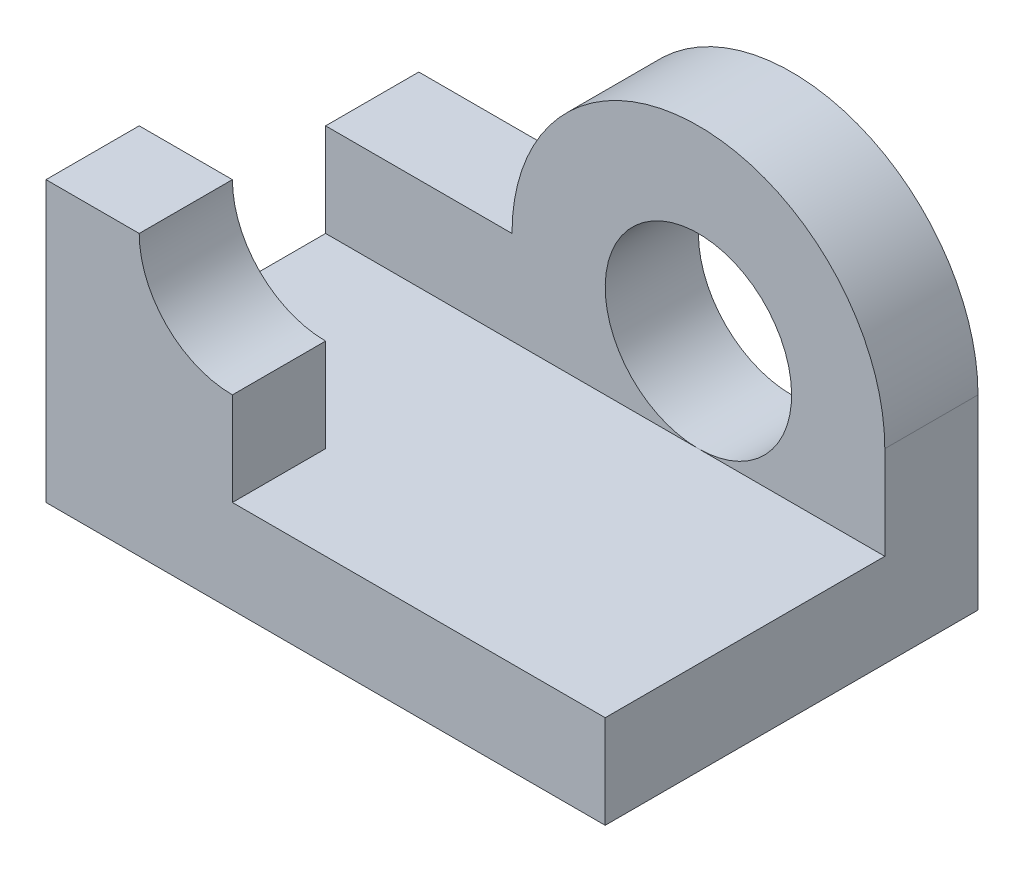
ISO-10303-21;
HEADER;
FILE_DESCRIPTION(('STEP AP214'),'2;1');
FILE_NAME('part.step','',(''),(''),'','','');
FILE_SCHEMA(('AUTOMOTIVE_DESIGN { 1 0 10303 214 1 1 1 1 }'));
ENDSEC;
DATA;
#1=APPLICATION_CONTEXT('core data for automotive mechanical design processes');
#2=APPLICATION_PROTOCOL_DEFINITION('international standard','automotive_design',2000,#1);
#3=PRODUCT_CONTEXT('',#1,'mechanical');
#4=PRODUCT('Part','Part','',(#3));
#5=PRODUCT_RELATED_PRODUCT_CATEGORY('part','',(#4));
#6=PRODUCT_DEFINITION_FORMATION('','',#4);
#7=PRODUCT_DEFINITION_CONTEXT('part definition',#1,'design');
#8=PRODUCT_DEFINITION('design','',#6,#7);
#9=PRODUCT_DEFINITION_SHAPE('','',#8);
#10=(LENGTH_UNIT() NAMED_UNIT(*) SI_UNIT(.MILLI.,.METRE.));
#11=(NAMED_UNIT(*) PLANE_ANGLE_UNIT() SI_UNIT($,.RADIAN.));
#12=(NAMED_UNIT(*) SI_UNIT($,.STERADIAN.) SOLID_ANGLE_UNIT());
#13=UNCERTAINTY_MEASURE_WITH_UNIT(LENGTH_MEASURE(1.E-05),#10,'distance_accuracy_value','');
#14=(GEOMETRIC_REPRESENTATION_CONTEXT(3) GLOBAL_UNCERTAINTY_ASSIGNED_CONTEXT((#13)) GLOBAL_UNIT_ASSIGNED_CONTEXT((#10,
#11,#12)) REPRESENTATION_CONTEXT('',''));
#15=CARTESIAN_POINT('',(0.,0.,0.));
#16=DIRECTION('',(0.,0.,1.));
#17=DIRECTION('',(1.,0.,0.));
#18=AXIS2_PLACEMENT_3D('',#15,#16,#17);
#19=CARTESIAN_POINT('',(10.,0.,5.));
#20=DIRECTION('',(1.,0.,0.));
#21=DIRECTION('',(0.,0.,-1.));
#22=AXIS2_PLACEMENT_3D('',#19,#20,#21);
#23=PLANE('',#22);
#24=DIRECTION('',(0.,-1.,0.));
#25=VECTOR('',#24,1.);
#26=CARTESIAN_POINT('',(10.,0.,5.));
#27=LINE('',#26,#25);
#28=CARTESIAN_POINT('',(10.,10.,5.));
#29=VERTEX_POINT('',#28);
#30=CARTESIAN_POINT('',(10.,5.,5.));
#31=VERTEX_POINT('',#30);
#32=EDGE_CURVE('E179',#29,#31,#27,.T.);
#33=ORIENTED_EDGE('',*,*,#32,.T.);
#34=DIRECTION('',(0.,0.,-1.));
#35=VECTOR('',#34,1.);
#36=CARTESIAN_POINT('',(10.,5.,20.));
#37=LINE('',#36,#35);
#38=CARTESIAN_POINT('',(10.,5.,20.));
#39=VERTEX_POINT('',#38);
#40=EDGE_CURVE('E170',#39,#31,#37,.T.);
#41=ORIENTED_EDGE('',*,*,#40,.F.);
#42=DIRECTION('',(0.,-1.,0.));
#43=VECTOR('',#42,1.);
#44=CARTESIAN_POINT('',(10.,0.,20.));
#45=LINE('',#44,#43);
#46=CARTESIAN_POINT('',(10.,0.,20.));
#47=VERTEX_POINT('',#46);
#48=EDGE_CURVE('E167',#39,#47,#45,.T.);
#49=ORIENTED_EDGE('',*,*,#48,.T.);
#50=DIRECTION('',(0.,0.,-1.));
#51=VECTOR('',#50,1.);
#52=CARTESIAN_POINT('',(10.,0.,5.));
#53=LINE('',#52,#51);
#54=CARTESIAN_POINT('',(10.,0.,0.));
#55=VERTEX_POINT('',#54);
#56=EDGE_CURVE('E191',#47,#55,#53,.T.);
#57=ORIENTED_EDGE('',*,*,#56,.T.);
#58=DIRECTION('',(0.,-1.,0.));
#59=VECTOR('',#58,1.);
#60=CARTESIAN_POINT('',(10.,0.,0.));
#61=LINE('',#60,#59);
#62=CARTESIAN_POINT('',(10.,10.,0.));
#63=VERTEX_POINT('',#62);
#64=EDGE_CURVE('E195',#63,#55,#61,.T.);
#65=ORIENTED_EDGE('',*,*,#64,.F.);
#66=DIRECTION('',(0.,0.,-1.));
#67=VECTOR('',#66,1.);
#68=CARTESIAN_POINT('',(10.,10.,5.));
#69=LINE('',#68,#67);
#70=EDGE_CURVE('E11',#29,#63,#69,.T.);
#71=ORIENTED_EDGE('',*,*,#70,.F.);
#72=EDGE_LOOP('',(#33,#41,#49,#57,#65,#71));
#73=FACE_BOUND('',#72,.T.);
#74=ADVANCED_FACE('F35',(#73),#23,.T.);
#75=CARTESIAN_POINT('',(0.,10.,5.));
#76=DIRECTION('',(0.,0.,-1.));
#77=DIRECTION('',(-1.,0.,0.));
#78=AXIS2_PLACEMENT_3D('',#75,#76,#77);
#79=CYLINDRICAL_SURFACE('',#78,10.);
#80=CARTESIAN_POINT('',(0.,10.,0.));
#81=DIRECTION('',(0.,0.,1.));
#82=DIRECTION('',(1.,0.,0.));
#83=AXIS2_PLACEMENT_3D('',#80,#81,#82);
#84=CIRCLE('',#83,10.);
#85=CARTESIAN_POINT('',(-10.,10.,0.));
#86=VERTEX_POINT('',#85);
#87=EDGE_CURVE('E197',#63,#86,#84,.T.);
#88=ORIENTED_EDGE('',*,*,#87,.T.);
#89=DIRECTION('',(0.,0.,-1.));
#90=VECTOR('',#89,1.);
#91=CARTESIAN_POINT('',(-10.,10.,5.));
#92=LINE('',#91,#90);
#93=CARTESIAN_POINT('',(-10.,10.,5.));
#94=VERTEX_POINT('',#93);
#95=EDGE_CURVE('E43',#94,#86,#92,.T.);
#96=ORIENTED_EDGE('',*,*,#95,.F.);
#97=CARTESIAN_POINT('',(0.,10.,5.));
#98=DIRECTION('',(0.,0.,1.));
#99=DIRECTION('',(1.,0.,0.));
#100=AXIS2_PLACEMENT_3D('',#97,#98,#99);
#101=CIRCLE('',#100,10.);
#102=EDGE_CURVE('E183',#29,#94,#101,.T.);
#103=ORIENTED_EDGE('',*,*,#102,.F.);
#104=ORIENTED_EDGE('',*,*,#70,.T.);
#105=EDGE_LOOP('',(#88,#96,#103,#104));
#106=FACE_BOUND('',#105,.T.);
#107=ADVANCED_FACE('F221',(#106),#79,.T.);
#108=CARTESIAN_POINT('',(0.,10.,5.));
#109=DIRECTION('',(0.,-1.,0.));
#110=DIRECTION('',(1.,0.,0.));
#111=AXIS2_PLACEMENT_3D('',#108,#109,#110);
#112=PLANE('',#111);
#113=DIRECTION('',(-1.,0.,0.));
#114=VECTOR('',#113,1.);
#115=CARTESIAN_POINT('',(0.,10.,0.));
#116=LINE('',#115,#114);
#117=CARTESIAN_POINT('',(-20.,10.,0.));
#118=VERTEX_POINT('',#117);
#119=EDGE_CURVE('E200',#86,#118,#116,.T.);
#120=ORIENTED_EDGE('',*,*,#119,.T.);
#121=DIRECTION('',(0.,0.,-1.));
#122=VECTOR('',#121,1.);
#123=CARTESIAN_POINT('',(-20.,10.,5.));
#124=LINE('',#123,#122);
#125=CARTESIAN_POINT('',(-20.,10.,5.));
#126=VERTEX_POINT('',#125);
#127=EDGE_CURVE('E211',#126,#118,#124,.T.);
#128=ORIENTED_EDGE('',*,*,#127,.F.);
#129=DIRECTION('',(-1.,0.,0.));
#130=VECTOR('',#129,1.);
#131=CARTESIAN_POINT('',(0.,10.,5.));
#132=LINE('',#131,#130);
#133=EDGE_CURVE('E186',#94,#126,#132,.T.);
#134=ORIENTED_EDGE('',*,*,#133,.F.);
#135=ORIENTED_EDGE('',*,*,#95,.T.);
#136=EDGE_LOOP('',(#120,#128,#134,#135));
#137=FACE_BOUND('',#136,.T.);
#138=ADVANCED_FACE('F216',(#137),#112,.F.);
#139=CARTESIAN_POINT('',(-20.,0.,5.));
#140=DIRECTION('',(-1.,0.,0.));
#141=DIRECTION('',(0.,0.,1.));
#142=AXIS2_PLACEMENT_3D('',#139,#140,#141);
#143=PLANE('',#142);
#144=ORIENTED_EDGE('',*,*,#127,.T.);
#145=DIRECTION('',(0.,1.,0.));
#146=VECTOR('',#145,1.);
#147=CARTESIAN_POINT('',(-20.,0.,0.));
#148=LINE('',#147,#146);
#149=CARTESIAN_POINT('',(-20.,0.,0.));
#150=VERTEX_POINT('',#149);
#151=EDGE_CURVE('E203',#150,#118,#148,.T.);
#152=ORIENTED_EDGE('',*,*,#151,.F.);
#153=DIRECTION('',(0.,0.,-1.));
#154=VECTOR('',#153,1.);
#155=CARTESIAN_POINT('',(-20.,0.,5.));
#156=LINE('',#155,#154);
#157=CARTESIAN_POINT('',(-20.,0.,20.));
#158=VERTEX_POINT('',#157);
#159=EDGE_CURVE('E209',#158,#150,#156,.T.);
#160=ORIENTED_EDGE('',*,*,#159,.F.);
#161=DIRECTION('',(0.,1.,0.));
#162=VECTOR('',#161,1.);
#163=CARTESIAN_POINT('',(-20.,0.,20.));
#164=LINE('',#163,#162);
#165=CARTESIAN_POINT('',(-20.,15.,20.));
#166=VERTEX_POINT('',#165);
#167=EDGE_CURVE('E162',#158,#166,#164,.T.);
#168=ORIENTED_EDGE('',*,*,#167,.T.);
#169=DIRECTION('',(0.,0.,-1.));
#170=VECTOR('',#169,1.);
#171=CARTESIAN_POINT('',(-20.,15.,20.));
#172=LINE('',#171,#170);
#173=CARTESIAN_POINT('',(-20.,15.,15.));
#174=VERTEX_POINT('',#173);
#175=EDGE_CURVE('E131',#166,#174,#172,.T.);
#176=ORIENTED_EDGE('',*,*,#175,.T.);
#177=DIRECTION('',(0.,1.,0.));
#178=VECTOR('',#177,1.);
#179=CARTESIAN_POINT('',(-20.,0.,15.));
#180=LINE('',#179,#178);
#181=CARTESIAN_POINT('',(-20.,5.,15.));
#182=VERTEX_POINT('',#181);
#183=EDGE_CURVE('E151',#182,#174,#180,.T.);
#184=ORIENTED_EDGE('',*,*,#183,.F.);
#185=DIRECTION('',(0.,0.,-1.));
#186=VECTOR('',#185,1.);
#187=CARTESIAN_POINT('',(-20.,5.,20.));
#188=LINE('',#187,#186);
#189=CARTESIAN_POINT('',(-20.,5.,5.));
#190=VERTEX_POINT('',#189);
#191=EDGE_CURVE('E55',#182,#190,#188,.T.);
#192=ORIENTED_EDGE('',*,*,#191,.T.);
#193=DIRECTION('',(0.,1.,0.));
#194=VECTOR('',#193,1.);
#195=CARTESIAN_POINT('',(-20.,0.,5.));
#196=LINE('',#195,#194);
#197=EDGE_CURVE('E189',#190,#126,#196,.T.);
#198=ORIENTED_EDGE('',*,*,#197,.T.);
#199=EDGE_LOOP('',(#144,#152,#160,#168,#176,#184,#192,#198));
#200=FACE_BOUND('',#199,.T.);
#201=ADVANCED_FACE('F234',(#200),#143,.T.);
#202=CARTESIAN_POINT('',(0.,10.,5.));
#203=DIRECTION('',(0.,0.,-1.));
#204=DIRECTION('',(-1.,0.,0.));
#205=AXIS2_PLACEMENT_3D('',#202,#203,#204);
#206=CYLINDRICAL_SURFACE('',#205,5.);
#207=CARTESIAN_POINT('',(0.,10.,0.));
#208=DIRECTION('',(0.,0.,1.));
#209=DIRECTION('',(1.,0.,0.));
#210=AXIS2_PLACEMENT_3D('',#207,#208,#209);
#211=CIRCLE('',#210,5.);
#212=CARTESIAN_POINT('',(5.,10.,0.));
#213=VERTEX_POINT('',#212);
#214=EDGE_CURVE('E192',#213,#213,#211,.T.);
#215=ORIENTED_EDGE('',*,*,#214,.F.);
#216=EDGE_LOOP('',(#215));
#217=FACE_BOUND('',#216,.T.);
#218=CARTESIAN_POINT('',(0.,10.,5.));
#219=DIRECTION('',(0.,0.,1.));
#220=DIRECTION('',(1.,0.,0.));
#221=AXIS2_PLACEMENT_3D('',#218,#219,#220);
#222=CIRCLE('',#221,5.);
#223=CARTESIAN_POINT('',(0.,5.,5.));
#224=VERTEX_POINT('',#223);
#225=EDGE_CURVE('E176',#224,#224,#222,.T.);
#226=ORIENTED_EDGE('',*,*,#225,.T.);
#227=EDGE_LOOP('',(#226));
#228=FACE_BOUND('',#227,.T.);
#229=ADVANCED_FACE('F37',(#217,#228),#206,.F.);
#230=CARTESIAN_POINT('',(0.,0.,5.));
#231=DIRECTION('',(0.,-1.,0.));
#232=DIRECTION('',(1.,0.,0.));
#233=AXIS2_PLACEMENT_3D('',#230,#231,#232);
#234=PLANE('',#233);
#235=DIRECTION('',(-1.,0.,0.));
#236=VECTOR('',#235,1.);
#237=CARTESIAN_POINT('',(0.,0.,0.));
#238=LINE('',#237,#236);
#239=EDGE_CURVE('E180',#55,#150,#238,.T.);
#240=ORIENTED_EDGE('',*,*,#239,.F.);
#241=ORIENTED_EDGE('',*,*,#56,.F.);
#242=DIRECTION('',(-1.,0.,0.));
#243=VECTOR('',#242,1.);
#244=CARTESIAN_POINT('',(0.,0.,20.));
#245=LINE('',#244,#243);
#246=EDGE_CURVE('E164',#47,#158,#245,.T.);
#247=ORIENTED_EDGE('',*,*,#246,.T.);
#248=ORIENTED_EDGE('',*,*,#159,.T.);
#249=EDGE_LOOP('',(#240,#241,#247,#248));
#250=FACE_BOUND('',#249,.T.);
#251=ADVANCED_FACE('F231',(#250),#234,.T.);
#252=CARTESIAN_POINT('',(0.,0.,5.));
#253=DIRECTION('',(0.,0.,1.));
#254=DIRECTION('',(1.,0.,0.));
#255=AXIS2_PLACEMENT_3D('',#252,#253,#254);
#256=PLANE('',#255);
#257=DIRECTION('',(-1.,0.,0.));
#258=VECTOR('',#257,1.);
#259=CARTESIAN_POINT('',(0.,5.,5.));
#260=LINE('',#259,#258);
#261=EDGE_CURVE('E175',#31,#224,#260,.T.);
#262=ORIENTED_EDGE('',*,*,#261,.F.);
#263=ORIENTED_EDGE('',*,*,#32,.F.);
#264=ORIENTED_EDGE('',*,*,#102,.T.);
#265=ORIENTED_EDGE('',*,*,#133,.T.);
#266=ORIENTED_EDGE('',*,*,#197,.F.);
#267=EDGE_CURVE('E173',#224,#190,#260,.T.);
#268=ORIENTED_EDGE('',*,*,#267,.F.);
#269=ORIENTED_EDGE('',*,*,#225,.F.);
#270=EDGE_LOOP('',(#262,#263,#264,#265,#266,#268,#269));
#271=FACE_BOUND('',#270,.T.);
#272=ADVANCED_FACE('F240',(#271),#256,.T.);
#273=CARTESIAN_POINT('',(0.,0.,0.));
#274=DIRECTION('',(0.,0.,1.));
#275=DIRECTION('',(1.,0.,0.));
#276=AXIS2_PLACEMENT_3D('',#273,#274,#275);
#277=PLANE('',#276);
#278=ORIENTED_EDGE('',*,*,#214,.T.);
#279=EDGE_LOOP('',(#278));
#280=FACE_BOUND('',#279,.T.);
#281=ORIENTED_EDGE('',*,*,#64,.T.);
#282=ORIENTED_EDGE('',*,*,#239,.T.);
#283=ORIENTED_EDGE('',*,*,#151,.T.);
#284=ORIENTED_EDGE('',*,*,#119,.F.);
#285=ORIENTED_EDGE('',*,*,#87,.F.);
#286=EDGE_LOOP('',(#281,#282,#283,#284,#285));
#287=FACE_BOUND('',#286,.T.);
#288=ADVANCED_FACE('F224',(#280,#287),#277,.F.);
#289=CARTESIAN_POINT('',(0.,5.,20.));
#290=DIRECTION('',(0.,1.,0.));
#291=DIRECTION('',(0.,0.,1.));
#292=AXIS2_PLACEMENT_3D('',#289,#290,#291);
#293=PLANE('',#292);
#294=DIRECTION('',(0.,0.,-1.));
#295=VECTOR('',#294,1.);
#296=CARTESIAN_POINT('',(-10.,5.,20.));
#297=LINE('',#296,#295);
#298=CARTESIAN_POINT('',(-10.,5.,20.));
#299=VERTEX_POINT('',#298);
#300=CARTESIAN_POINT('',(-10.,5.,15.));
#301=VERTEX_POINT('',#300);
#302=EDGE_CURVE('E158',#299,#301,#297,.T.);
#303=ORIENTED_EDGE('',*,*,#302,.F.);
#304=DIRECTION('',(1.,0.,0.));
#305=VECTOR('',#304,1.);
#306=CARTESIAN_POINT('',(0.,5.,20.));
#307=LINE('',#306,#305);
#308=EDGE_CURVE('E130',#299,#39,#307,.T.);
#309=ORIENTED_EDGE('',*,*,#308,.T.);
#310=ORIENTED_EDGE('',*,*,#40,.T.);
#311=ORIENTED_EDGE('',*,*,#261,.T.);
#312=ORIENTED_EDGE('',*,*,#267,.T.);
#313=ORIENTED_EDGE('',*,*,#191,.F.);
#314=DIRECTION('',(1.,0.,0.));
#315=VECTOR('',#314,1.);
#316=CARTESIAN_POINT('',(0.,5.,15.));
#317=LINE('',#316,#315);
#318=EDGE_CURVE('E50',#182,#301,#317,.T.);
#319=ORIENTED_EDGE('',*,*,#318,.T.);
#320=EDGE_LOOP('',(#303,#309,#310,#311,#312,#313,#319));
#321=FACE_BOUND('',#320,.T.);
#322=ADVANCED_FACE('F248',(#321),#293,.T.);
#323=CARTESIAN_POINT('',(0.,0.,20.));
#324=DIRECTION('',(0.,0.,1.));
#325=DIRECTION('',(1.,0.,0.));
#326=AXIS2_PLACEMENT_3D('',#323,#324,#325);
#327=PLANE('',#326);
#328=ORIENTED_EDGE('',*,*,#308,.F.);
#329=DIRECTION('',(0.,-1.,0.));
#330=VECTOR('',#329,1.);
#331=CARTESIAN_POINT('',(-10.,0.,20.));
#332=LINE('',#331,#330);
#333=CARTESIAN_POINT('',(-10.,10.,20.));
#334=VERTEX_POINT('',#333);
#335=EDGE_CURVE('E139',#334,#299,#332,.T.);
#336=ORIENTED_EDGE('',*,*,#335,.F.);
#337=CARTESIAN_POINT('',(-10.,15.,20.));
#338=DIRECTION('',(0.,0.,1.));
#339=DIRECTION('',(1.,0.,0.));
#340=AXIS2_PLACEMENT_3D('',#337,#338,#339);
#341=CIRCLE('',#340,5.);
#342=CARTESIAN_POINT('',(-15.,15.,20.));
#343=VERTEX_POINT('',#342);
#344=EDGE_CURVE('E122',#343,#334,#341,.T.);
#345=ORIENTED_EDGE('',*,*,#344,.F.);
#346=DIRECTION('',(1.,0.,0.));
#347=VECTOR('',#346,1.);
#348=CARTESIAN_POINT('',(0.,15.,20.));
#349=LINE('',#348,#347);
#350=EDGE_CURVE('E137',#166,#343,#349,.T.);
#351=ORIENTED_EDGE('',*,*,#350,.F.);
#352=ORIENTED_EDGE('',*,*,#167,.F.);
#353=ORIENTED_EDGE('',*,*,#246,.F.);
#354=ORIENTED_EDGE('',*,*,#48,.F.);
#355=EDGE_LOOP('',(#328,#336,#345,#351,#352,#353,#354));
#356=FACE_BOUND('',#355,.T.);
#357=ADVANCED_FACE('F135',(#356),#327,.T.);
#358=CARTESIAN_POINT('',(-10.,15.,20.));
#359=DIRECTION('',(0.,0.,-1.));
#360=DIRECTION('',(-1.,0.,0.));
#361=AXIS2_PLACEMENT_3D('',#358,#359,#360);
#362=CYLINDRICAL_SURFACE('',#361,5.);
#363=CARTESIAN_POINT('',(-10.,15.,15.));
#364=DIRECTION('',(0.,0.,1.));
#365=DIRECTION('',(1.,0.,0.));
#366=AXIS2_PLACEMENT_3D('',#363,#364,#365);
#367=CIRCLE('',#366,5.);
#368=CARTESIAN_POINT('',(-15.,15.,15.));
#369=VERTEX_POINT('',#368);
#370=CARTESIAN_POINT('',(-10.,10.,15.));
#371=VERTEX_POINT('',#370);
#372=EDGE_CURVE('E125',#369,#371,#367,.T.);
#373=ORIENTED_EDGE('',*,*,#372,.F.);
#374=DIRECTION('',(0.,0.,-1.));
#375=VECTOR('',#374,1.);
#376=CARTESIAN_POINT('',(-15.,15.,20.));
#377=LINE('',#376,#375);
#378=EDGE_CURVE('E119',#343,#369,#377,.T.);
#379=ORIENTED_EDGE('',*,*,#378,.F.);
#380=ORIENTED_EDGE('',*,*,#344,.T.);
#381=DIRECTION('',(0.,0.,-1.));
#382=VECTOR('',#381,1.);
#383=CARTESIAN_POINT('',(-10.,10.,20.));
#384=LINE('',#383,#382);
#385=EDGE_CURVE('E145',#334,#371,#384,.T.);
#386=ORIENTED_EDGE('',*,*,#385,.T.);
#387=EDGE_LOOP('',(#373,#379,#380,#386));
#388=FACE_BOUND('',#387,.T.);
#389=ADVANCED_FACE('F121',(#388),#362,.F.);
#390=CARTESIAN_POINT('',(0.,15.,20.));
#391=DIRECTION('',(0.,1.,0.));
#392=DIRECTION('',(0.,0.,1.));
#393=AXIS2_PLACEMENT_3D('',#390,#391,#392);
#394=PLANE('',#393);
#395=DIRECTION('',(1.,0.,0.));
#396=VECTOR('',#395,1.);
#397=CARTESIAN_POINT('',(0.,15.,15.));
#398=LINE('',#397,#396);
#399=EDGE_CURVE('E149',#174,#369,#398,.T.);
#400=ORIENTED_EDGE('',*,*,#399,.F.);
#401=ORIENTED_EDGE('',*,*,#175,.F.);
#402=ORIENTED_EDGE('',*,*,#350,.T.);
#403=ORIENTED_EDGE('',*,*,#378,.T.);
#404=EDGE_LOOP('',(#400,#401,#402,#403));
#405=FACE_BOUND('',#404,.T.);
#406=ADVANCED_FACE('F143',(#405),#394,.T.);
#407=CARTESIAN_POINT('',(-10.,0.,20.));
#408=DIRECTION('',(1.,0.,0.));
#409=DIRECTION('',(0.,0.,-1.));
#410=AXIS2_PLACEMENT_3D('',#407,#408,#409);
#411=PLANE('',#410);
#412=DIRECTION('',(0.,-1.,0.));
#413=VECTOR('',#412,1.);
#414=CARTESIAN_POINT('',(-10.,0.,15.));
#415=LINE('',#414,#413);
#416=EDGE_CURVE('E140',#371,#301,#415,.T.);
#417=ORIENTED_EDGE('',*,*,#416,.F.);
#418=ORIENTED_EDGE('',*,*,#385,.F.);
#419=ORIENTED_EDGE('',*,*,#335,.T.);
#420=ORIENTED_EDGE('',*,*,#302,.T.);
#421=EDGE_LOOP('',(#417,#418,#419,#420));
#422=FACE_BOUND('',#421,.T.);
#423=ADVANCED_FACE('F247',(#422),#411,.T.);
#424=CARTESIAN_POINT('',(0.,0.,15.));
#425=DIRECTION('',(0.,0.,1.));
#426=DIRECTION('',(1.,0.,0.));
#427=AXIS2_PLACEMENT_3D('',#424,#425,#426);
#428=PLANE('',#427);
#429=ORIENTED_EDGE('',*,*,#372,.T.);
#430=ORIENTED_EDGE('',*,*,#416,.T.);
#431=ORIENTED_EDGE('',*,*,#318,.F.);
#432=ORIENTED_EDGE('',*,*,#183,.T.);
#433=ORIENTED_EDGE('',*,*,#399,.T.);
#434=EDGE_LOOP('',(#429,#430,#431,#432,#433));
#435=FACE_BOUND('',#434,.T.);
#436=ADVANCED_FACE('F244',(#435),#428,.F.);
#437=CLOSED_SHELL('',(#74,#107,#138,#201,#229,#251,#272,#288,#322,#357,#389,#406,#423,#436));
#438=MANIFOLD_SOLID_BREP('B2',#437);
#439=ADVANCED_BREP_SHAPE_REPRESENTATION('',(#18,#438),#14);
#440=SHAPE_DEFINITION_REPRESENTATION(#9,#439);
ENDSEC;
END-ISO-10303-21;
